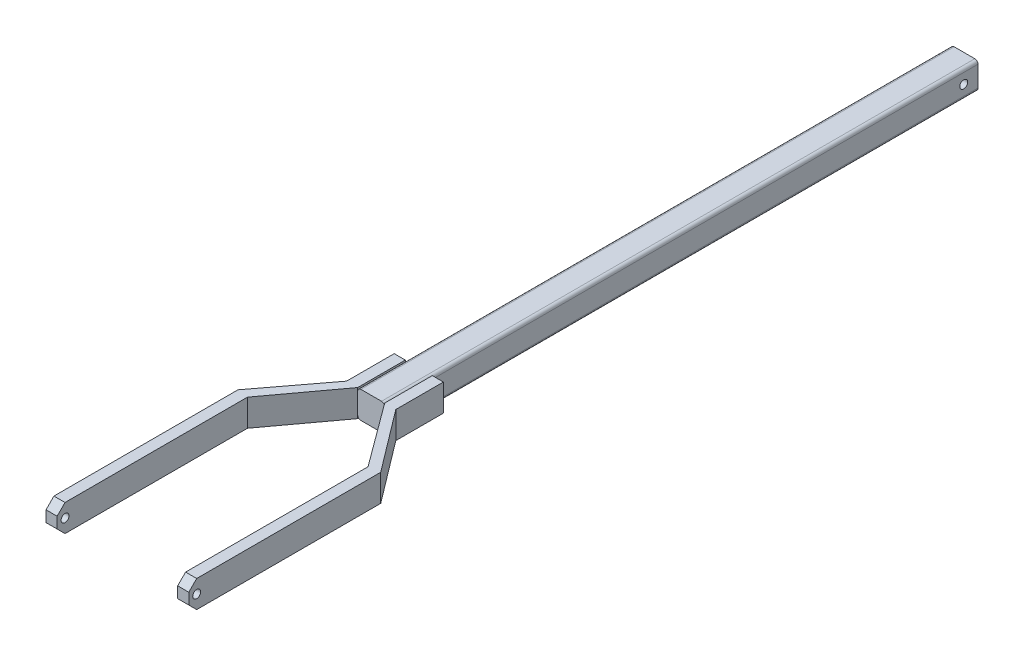
ISO-10303-21;
HEADER;
FILE_DESCRIPTION(('STEP AP214'),'2;1');
FILE_NAME('part.step','',(''),(''),'','','');
FILE_SCHEMA(('AUTOMOTIVE_DESIGN { 1 0 10303 214 1 1 1 1 }'));
ENDSEC;
DATA;
#1=APPLICATION_CONTEXT('core data for automotive mechanical design processes');
#2=APPLICATION_PROTOCOL_DEFINITION('international standard','automotive_design',2000,#1);
#3=PRODUCT_CONTEXT('',#1,'mechanical');
#4=PRODUCT('Part','Part','',(#3));
#5=PRODUCT_RELATED_PRODUCT_CATEGORY('part','',(#4));
#6=PRODUCT_DEFINITION_FORMATION('','',#4);
#7=PRODUCT_DEFINITION_CONTEXT('part definition',#1,'design');
#8=PRODUCT_DEFINITION('design','',#6,#7);
#9=PRODUCT_DEFINITION_SHAPE('','',#8);
#10=(LENGTH_UNIT() NAMED_UNIT(*) SI_UNIT(.MILLI.,.METRE.));
#11=(NAMED_UNIT(*) PLANE_ANGLE_UNIT() SI_UNIT($,.RADIAN.));
#12=(NAMED_UNIT(*) SI_UNIT($,.STERADIAN.) SOLID_ANGLE_UNIT());
#13=UNCERTAINTY_MEASURE_WITH_UNIT(LENGTH_MEASURE(1.E-05),#10,'distance_accuracy_value','');
#14=(GEOMETRIC_REPRESENTATION_CONTEXT(3) GLOBAL_UNCERTAINTY_ASSIGNED_CONTEXT((#13)) GLOBAL_UNIT_ASSIGNED_CONTEXT((#10,
#11,#12)) REPRESENTATION_CONTEXT('',''));
#15=CARTESIAN_POINT('',(0.,0.,0.));
#16=DIRECTION('',(0.,0.,1.));
#17=DIRECTION('',(1.,0.,0.));
#18=AXIS2_PLACEMENT_3D('',#15,#16,#17);
#19=CARTESIAN_POINT('',(-25.1421016274333,24.9094176838767,374.));
#20=DIRECTION('',(0.,0.,-1.));
#21=DIRECTION('',(-1.,0.,0.));
#22=AXIS2_PLACEMENT_3D('',#19,#20,#21);
#23=CYLINDRICAL_SURFACE('',#22,2.);
#24=CARTESIAN_POINT('',(-25.1421016274333,24.9094176838767,0.));
#25=DIRECTION('',(0.,0.,1.));
#26=DIRECTION('',(-1.,0.,0.));
#27=AXIS2_PLACEMENT_3D('',#24,#25,#26);
#28=CIRCLE('',#27,2.);
#29=CARTESIAN_POINT('',(-23.1421016274333,24.9094176838767,0.));
#30=VERTEX_POINT('',#29);
#31=CARTESIAN_POINT('',(-25.1421016274333,26.9094176838767,0.));
#32=VERTEX_POINT('',#31);
#33=EDGE_CURVE('E321',#30,#32,#28,.T.);
#34=ORIENTED_EDGE('',*,*,#33,.T.);
#35=DIRECTION('',(0.,0.,-1.));
#36=VECTOR('',#35,1.);
#37=CARTESIAN_POINT('',(-25.1421016274333,26.9094176838767,374.));
#38=LINE('',#37,#36);
#39=CARTESIAN_POINT('',(-25.1421016274333,26.9094176838767,374.));
#40=VERTEX_POINT('',#39);
#41=EDGE_CURVE('E11',#40,#32,#38,.T.);
#42=ORIENTED_EDGE('',*,*,#41,.F.);
#43=CARTESIAN_POINT('',(-25.1421016274333,24.9094176838767,374.));
#44=DIRECTION('',(0.,0.,1.));
#45=DIRECTION('',(-1.,0.,0.));
#46=AXIS2_PLACEMENT_3D('',#43,#44,#45);
#47=CIRCLE('',#46,2.);
#48=CARTESIAN_POINT('',(-23.1421016274333,24.9094176838767,374.));
#49=VERTEX_POINT('',#48);
#50=EDGE_CURVE('E342',#49,#40,#47,.T.);
#51=ORIENTED_EDGE('',*,*,#50,.F.);
#52=DIRECTION('',(0.,0.,-1.));
#53=VECTOR('',#52,1.);
#54=CARTESIAN_POINT('',(-23.1421016274333,24.9094176838767,374.));
#55=LINE('',#54,#53);
#56=CARTESIAN_POINT('',(-23.1421016274333,24.9094176838767,344.));
#57=VERTEX_POINT('',#56);
#58=EDGE_CURVE('E384',#49,#57,#55,.T.);
#59=ORIENTED_EDGE('',*,*,#58,.T.);
#60=EDGE_CURVE('E364',#57,#30,#55,.T.);
#61=ORIENTED_EDGE('',*,*,#60,.T.);
#62=EDGE_LOOP('',(#34,#42,#51,#59,#61));
#63=FACE_BOUND('',#62,.T.);
#64=ADVANCED_FACE('F33',(#63),#23,.T.);
#65=CARTESIAN_POINT('',(-38.1421016274332,26.9094176838767,374.));
#66=DIRECTION('',(0.,-1.,0.));
#67=DIRECTION('',(0.,0.,-1.));
#68=AXIS2_PLACEMENT_3D('',#65,#66,#67);
#69=PLANE('',#68);
#70=DIRECTION('',(-1.,0.,0.));
#71=VECTOR('',#70,1.);
#72=CARTESIAN_POINT('',(-38.1421016274332,26.9094176838767,0.));
#73=LINE('',#72,#71);
#74=CARTESIAN_POINT('',(-38.1421016274332,26.9094176838767,0.));
#75=VERTEX_POINT('',#74);
#76=EDGE_CURVE('E367',#32,#75,#73,.T.);
#77=ORIENTED_EDGE('',*,*,#76,.T.);
#78=DIRECTION('',(0.,0.,-1.));
#79=VECTOR('',#78,1.);
#80=CARTESIAN_POINT('',(-38.1421016274332,26.9094176838767,374.));
#81=LINE('',#80,#79);
#82=CARTESIAN_POINT('',(-38.1421016274332,26.9094176838767,374.));
#83=VERTEX_POINT('',#82);
#84=EDGE_CURVE('E41',#83,#75,#81,.T.);
#85=ORIENTED_EDGE('',*,*,#84,.F.);
#86=DIRECTION('',(-1.,0.,0.));
#87=VECTOR('',#86,1.);
#88=CARTESIAN_POINT('',(-38.1421016274332,26.9094176838767,374.));
#89=LINE('',#88,#87);
#90=EDGE_CURVE('E345',#40,#83,#89,.T.);
#91=ORIENTED_EDGE('',*,*,#90,.F.);
#92=ORIENTED_EDGE('',*,*,#41,.T.);
#93=EDGE_LOOP('',(#77,#85,#91,#92));
#94=FACE_BOUND('',#93,.T.);
#95=ADVANCED_FACE('F558',(#94),#69,.F.);
#96=CARTESIAN_POINT('',(-38.1421016274333,24.9094176838767,374.));
#97=DIRECTION('',(0.,0.,-1.));
#98=DIRECTION('',(-1.,0.,0.));
#99=AXIS2_PLACEMENT_3D('',#96,#97,#98);
#100=CYLINDRICAL_SURFACE('',#99,2.);
#101=CARTESIAN_POINT('',(-38.1421016274333,24.9094176838767,0.));
#102=DIRECTION('',(0.,0.,1.));
#103=DIRECTION('',(-1.,0.,0.));
#104=AXIS2_PLACEMENT_3D('',#101,#102,#103);
#105=CIRCLE('',#104,2.);
#106=CARTESIAN_POINT('',(-40.1421016274333,24.9094176838767,0.));
#107=VERTEX_POINT('',#106);
#108=EDGE_CURVE('E369',#75,#107,#105,.T.);
#109=ORIENTED_EDGE('',*,*,#108,.T.);
#110=DIRECTION('',(0.,0.,-1.));
#111=VECTOR('',#110,1.);
#112=CARTESIAN_POINT('',(-40.1421016274333,24.9094176838767,374.));
#113=LINE('',#112,#111);
#114=CARTESIAN_POINT('',(-40.1421016274333,24.9094176838767,344.));
#115=VERTEX_POINT('',#114);
#116=EDGE_CURVE('E400',#115,#107,#113,.T.);
#117=ORIENTED_EDGE('',*,*,#116,.F.);
#118=CARTESIAN_POINT('',(-40.1421016274333,24.9094176838767,374.));
#119=VERTEX_POINT('',#118);
#120=EDGE_CURVE('E401',#119,#115,#113,.T.);
#121=ORIENTED_EDGE('',*,*,#120,.F.);
#122=CARTESIAN_POINT('',(-38.1421016274333,24.9094176838767,374.));
#123=DIRECTION('',(0.,0.,1.));
#124=DIRECTION('',(-1.,0.,0.));
#125=AXIS2_PLACEMENT_3D('',#122,#123,#124);
#126=CIRCLE('',#125,2.);
#127=EDGE_CURVE('E348',#83,#119,#126,.T.);
#128=ORIENTED_EDGE('',*,*,#127,.F.);
#129=ORIENTED_EDGE('',*,*,#84,.T.);
#130=EDGE_LOOP('',(#109,#117,#121,#128,#129));
#131=FACE_BOUND('',#130,.T.);
#132=ADVANCED_FACE('F408',(#131),#100,.T.);
#133=CARTESIAN_POINT('',(-40.1421016274333,24.9094176838767,374.));
#134=DIRECTION('',(1.,0.,0.));
#135=DIRECTION('',(0.,1.,0.));
#136=AXIS2_PLACEMENT_3D('',#133,#134,#135);
#137=PLANE('',#136);
#138=CARTESIAN_POINT('',(-40.1421016274333,18.4094176838767,9.));
#139=DIRECTION('',(1.,0.,0.));
#140=DIRECTION('',(0.,1.,0.));
#141=AXIS2_PLACEMENT_3D('',#138,#139,#140);
#142=CIRCLE('',#141,2.5);
#143=CARTESIAN_POINT('',(-40.1421016274333,20.9094176838767,9.));
#144=VERTEX_POINT('',#143);
#145=EDGE_CURVE('E495',#144,#144,#142,.T.);
#146=ORIENTED_EDGE('',*,*,#145,.T.);
#147=EDGE_LOOP('',(#146));
#148=FACE_BOUND('',#147,.T.);
#149=DIRECTION('',(0.,0.,-1.));
#150=VECTOR('',#149,1.);
#151=CARTESIAN_POINT('',(-40.1421016274332,11.9094176838767,374.));
#152=LINE('',#151,#150);
#153=CARTESIAN_POINT('',(-40.1421016274333,11.9094176838767,344.));
#154=VERTEX_POINT('',#153);
#155=CARTESIAN_POINT('',(-40.1421016274332,11.9094176838767,0.));
#156=VERTEX_POINT('',#155);
#157=EDGE_CURVE('E396',#154,#156,#152,.T.);
#158=ORIENTED_EDGE('',*,*,#157,.F.);
#159=DIRECTION('',(0.,1.,0.));
#160=VECTOR('',#159,1.);
#161=CARTESIAN_POINT('',(-40.1421016274333,9.90941768387672,344.));
#162=LINE('',#161,#160);
#163=EDGE_CURVE('E272',#154,#115,#162,.T.);
#164=ORIENTED_EDGE('',*,*,#163,.T.);
#165=ORIENTED_EDGE('',*,*,#116,.T.);
#166=DIRECTION('',(0.,-1.,0.));
#167=VECTOR('',#166,1.);
#168=CARTESIAN_POINT('',(-40.1421016274333,24.9094176838767,0.));
#169=LINE('',#168,#167);
#170=EDGE_CURVE('E372',#107,#156,#169,.T.);
#171=ORIENTED_EDGE('',*,*,#170,.T.);
#172=EDGE_LOOP('',(#158,#164,#165,#171));
#173=FACE_BOUND('',#172,.T.);
#174=ADVANCED_FACE('F420',(#148,#173),#137,.F.);
#175=CARTESIAN_POINT('',(-38.1421016274332,11.9094176838767,374.));
#176=DIRECTION('',(0.,0.,-1.));
#177=DIRECTION('',(-1.,0.,0.));
#178=AXIS2_PLACEMENT_3D('',#175,#176,#177);
#179=CYLINDRICAL_SURFACE('',#178,2.);
#180=CARTESIAN_POINT('',(-38.1421016274332,11.9094176838767,0.));
#181=DIRECTION('',(0.,0.,1.));
#182=DIRECTION('',(-1.,0.,0.));
#183=AXIS2_PLACEMENT_3D('',#180,#181,#182);
#184=CIRCLE('',#183,2.);
#185=CARTESIAN_POINT('',(-38.1421016274332,9.90941768387672,0.));
#186=VERTEX_POINT('',#185);
#187=EDGE_CURVE('E375',#156,#186,#184,.T.);
#188=ORIENTED_EDGE('',*,*,#187,.T.);
#189=DIRECTION('',(0.,0.,-1.));
#190=VECTOR('',#189,1.);
#191=CARTESIAN_POINT('',(-38.1421016274332,9.90941768387672,374.));
#192=LINE('',#191,#190);
#193=CARTESIAN_POINT('',(-38.1421016274332,9.90941768387672,374.));
#194=VERTEX_POINT('',#193);
#195=EDGE_CURVE('E393',#194,#186,#192,.T.);
#196=ORIENTED_EDGE('',*,*,#195,.F.);
#197=CARTESIAN_POINT('',(-38.1421016274332,11.9094176838767,374.));
#198=DIRECTION('',(0.,0.,1.));
#199=DIRECTION('',(-1.,0.,0.));
#200=AXIS2_PLACEMENT_3D('',#197,#198,#199);
#201=CIRCLE('',#200,2.);
#202=CARTESIAN_POINT('',(-40.1421016274332,11.9094176838767,374.));
#203=VERTEX_POINT('',#202);
#204=EDGE_CURVE('E354',#203,#194,#201,.T.);
#205=ORIENTED_EDGE('',*,*,#204,.F.);
#206=EDGE_CURVE('E397',#203,#154,#152,.T.);
#207=ORIENTED_EDGE('',*,*,#206,.T.);
#208=ORIENTED_EDGE('',*,*,#157,.T.);
#209=EDGE_LOOP('',(#188,#196,#205,#207,#208));
#210=FACE_BOUND('',#209,.T.);
#211=ADVANCED_FACE('F584',(#210),#179,.T.);
#212=CARTESIAN_POINT('',(-38.1421016274332,9.90941768387672,374.));
#213=DIRECTION('',(0.,1.,0.));
#214=DIRECTION('',(0.,0.,1.));
#215=AXIS2_PLACEMENT_3D('',#212,#213,#214);
#216=PLANE('',#215);
#217=DIRECTION('',(1.,0.,0.));
#218=VECTOR('',#217,1.);
#219=CARTESIAN_POINT('',(-38.1421016274332,9.90941768387672,0.));
#220=LINE('',#219,#218);
#221=CARTESIAN_POINT('',(-25.1421016274333,9.90941768387672,0.));
#222=VERTEX_POINT('',#221);
#223=EDGE_CURVE('E377',#186,#222,#220,.T.);
#224=ORIENTED_EDGE('',*,*,#223,.T.);
#225=DIRECTION('',(0.,0.,-1.));
#226=VECTOR('',#225,1.);
#227=CARTESIAN_POINT('',(-25.1421016274333,9.90941768387672,374.));
#228=LINE('',#227,#226);
#229=CARTESIAN_POINT('',(-25.1421016274333,9.90941768387672,374.));
#230=VERTEX_POINT('',#229);
#231=EDGE_CURVE('E390',#230,#222,#228,.T.);
#232=ORIENTED_EDGE('',*,*,#231,.F.);
#233=DIRECTION('',(1.,0.,0.));
#234=VECTOR('',#233,1.);
#235=CARTESIAN_POINT('',(-38.1421016274332,9.90941768387672,374.));
#236=LINE('',#235,#234);
#237=EDGE_CURVE('E356',#194,#230,#236,.T.);
#238=ORIENTED_EDGE('',*,*,#237,.F.);
#239=ORIENTED_EDGE('',*,*,#195,.T.);
#240=EDGE_LOOP('',(#224,#232,#238,#239));
#241=FACE_BOUND('',#240,.T.);
#242=ADVANCED_FACE('F580',(#241),#216,.F.);
#243=CARTESIAN_POINT('',(-25.1421016274333,11.9094176838767,374.));
#244=DIRECTION('',(0.,0.,-1.));
#245=DIRECTION('',(-1.,0.,0.));
#246=AXIS2_PLACEMENT_3D('',#243,#244,#245);
#247=CYLINDRICAL_SURFACE('',#246,2.);
#248=CARTESIAN_POINT('',(-25.1421016274333,11.9094176838767,0.));
#249=DIRECTION('',(0.,0.,1.));
#250=DIRECTION('',(-1.,0.,0.));
#251=AXIS2_PLACEMENT_3D('',#248,#249,#250);
#252=CIRCLE('',#251,2.);
#253=CARTESIAN_POINT('',(-23.1421016274333,11.9094176838767,0.));
#254=VERTEX_POINT('',#253);
#255=EDGE_CURVE('E379',#222,#254,#252,.T.);
#256=ORIENTED_EDGE('',*,*,#255,.T.);
#257=DIRECTION('',(0.,0.,-1.));
#258=VECTOR('',#257,1.);
#259=CARTESIAN_POINT('',(-23.1421016274333,11.9094176838767,374.));
#260=LINE('',#259,#258);
#261=CARTESIAN_POINT('',(-23.1421016274333,11.9094176838767,344.));
#262=VERTEX_POINT('',#261);
#263=EDGE_CURVE('E387',#262,#254,#260,.T.);
#264=ORIENTED_EDGE('',*,*,#263,.F.);
#265=CARTESIAN_POINT('',(-23.1421016274333,11.9094176838767,374.));
#266=VERTEX_POINT('',#265);
#267=EDGE_CURVE('E388',#266,#262,#260,.T.);
#268=ORIENTED_EDGE('',*,*,#267,.F.);
#269=CARTESIAN_POINT('',(-25.1421016274333,11.9094176838767,374.));
#270=DIRECTION('',(0.,0.,1.));
#271=DIRECTION('',(-1.,0.,0.));
#272=AXIS2_PLACEMENT_3D('',#269,#270,#271);
#273=CIRCLE('',#272,2.);
#274=EDGE_CURVE('E358',#230,#266,#273,.T.);
#275=ORIENTED_EDGE('',*,*,#274,.F.);
#276=ORIENTED_EDGE('',*,*,#231,.T.);
#277=EDGE_LOOP('',(#256,#264,#268,#275,#276));
#278=FACE_BOUND('',#277,.T.);
#279=ADVANCED_FACE('F575',(#278),#247,.T.);
#280=CARTESIAN_POINT('',(-23.1421016274333,24.9094176838767,374.));
#281=DIRECTION('',(-1.,0.,0.));
#282=DIRECTION('',(0.,-1.,0.));
#283=AXIS2_PLACEMENT_3D('',#280,#281,#282);
#284=PLANE('',#283);
#285=CARTESIAN_POINT('',(-23.1421016274333,18.4094176838767,9.));
#286=DIRECTION('',(-1.,0.,0.));
#287=DIRECTION('',(0.,-1.,0.));
#288=AXIS2_PLACEMENT_3D('',#285,#286,#287);
#289=CIRCLE('',#288,2.5);
#290=CARTESIAN_POINT('',(-23.1421016274333,15.9094176838767,9.));
#291=VERTEX_POINT('',#290);
#292=EDGE_CURVE('E36',#291,#291,#289,.T.);
#293=ORIENTED_EDGE('',*,*,#292,.T.);
#294=EDGE_LOOP('',(#293));
#295=FACE_BOUND('',#294,.T.);
#296=ORIENTED_EDGE('',*,*,#60,.F.);
#297=DIRECTION('',(0.,1.,0.));
#298=VECTOR('',#297,1.);
#299=CARTESIAN_POINT('',(-23.1421016274333,9.90941768387672,344.));
#300=LINE('',#299,#298);
#301=EDGE_CURVE('E326',#262,#57,#300,.T.);
#302=ORIENTED_EDGE('',*,*,#301,.F.);
#303=ORIENTED_EDGE('',*,*,#263,.T.);
#304=DIRECTION('',(0.,1.,0.));
#305=VECTOR('',#304,1.);
#306=CARTESIAN_POINT('',(-23.1421016274333,24.9094176838767,0.));
#307=LINE('',#306,#305);
#308=EDGE_CURVE('E346',#254,#30,#307,.T.);
#309=ORIENTED_EDGE('',*,*,#308,.T.);
#310=EDGE_LOOP('',(#296,#302,#303,#309));
#311=FACE_BOUND('',#310,.T.);
#312=ADVANCED_FACE('F569',(#295,#311),#284,.F.);
#313=CARTESIAN_POINT('',(-25.1421016274333,24.9094176838767,374.));
#314=DIRECTION('',(0.,0.,-1.));
#315=DIRECTION('',(-1.,0.,0.));
#316=AXIS2_PLACEMENT_3D('',#313,#314,#315);
#317=PLANE('',#316);
#318=ORIENTED_EDGE('',*,*,#50,.T.);
#319=ORIENTED_EDGE('',*,*,#90,.T.);
#320=ORIENTED_EDGE('',*,*,#127,.T.);
#321=DIRECTION('',(0.,-1.,0.));
#322=VECTOR('',#321,1.);
#323=CARTESIAN_POINT('',(-40.1421016274333,24.9094176838767,374.));
#324=LINE('',#323,#322);
#325=EDGE_CURVE('E351',#119,#203,#324,.T.);
#326=ORIENTED_EDGE('',*,*,#325,.T.);
#327=ORIENTED_EDGE('',*,*,#204,.T.);
#328=ORIENTED_EDGE('',*,*,#237,.T.);
#329=ORIENTED_EDGE('',*,*,#274,.T.);
#330=DIRECTION('',(0.,1.,0.));
#331=VECTOR('',#330,1.);
#332=CARTESIAN_POINT('',(-23.1421016274333,24.9094176838767,374.));
#333=LINE('',#332,#331);
#334=EDGE_CURVE('E361',#266,#49,#333,.T.);
#335=ORIENTED_EDGE('',*,*,#334,.T.);
#336=EDGE_LOOP('',(#318,#319,#320,#326,#327,#328,#329,#335));
#337=FACE_BOUND('',#336,.T.);
#338=ADVANCED_FACE('F590',(#337),#317,.F.);
#339=CARTESIAN_POINT('',(-25.1421016274333,24.9094176838767,0.));
#340=DIRECTION('',(0.,0.,-1.));
#341=DIRECTION('',(-1.,0.,0.));
#342=AXIS2_PLACEMENT_3D('',#339,#340,#341);
#343=PLANE('',#342);
#344=ORIENTED_EDGE('',*,*,#33,.F.);
#345=ORIENTED_EDGE('',*,*,#308,.F.);
#346=ORIENTED_EDGE('',*,*,#255,.F.);
#347=ORIENTED_EDGE('',*,*,#223,.F.);
#348=ORIENTED_EDGE('',*,*,#187,.F.);
#349=ORIENTED_EDGE('',*,*,#170,.F.);
#350=ORIENTED_EDGE('',*,*,#108,.F.);
#351=ORIENTED_EDGE('',*,*,#76,.F.);
#352=EDGE_LOOP('',(#344,#345,#346,#347,#348,#349,#350,#351));
#353=FACE_BOUND('',#352,.T.);
#354=ADVANCED_FACE('F415',(#353),#343,.T.);
#355=CARTESIAN_POINT('',(-23.1421016274333,9.90941768387672,374.));
#356=DIRECTION('',(-1.,0.,0.));
#357=DIRECTION('',(0.,0.,1.));
#358=AXIS2_PLACEMENT_3D('',#355,#356,#357);
#359=PLANE('',#358);
#360=ORIENTED_EDGE('',*,*,#58,.F.);
#361=DIRECTION('',(0.,1.,0.));
#362=VECTOR('',#361,1.);
#363=CARTESIAN_POINT('',(-23.1421016274333,9.90941768387672,374.));
#364=LINE('',#363,#362);
#365=CARTESIAN_POINT('',(-23.1421016274333,26.9094176838767,374.));
#366=VERTEX_POINT('',#365);
#367=EDGE_CURVE('E322',#49,#366,#364,.T.);
#368=ORIENTED_EDGE('',*,*,#367,.T.);
#369=DIRECTION('',(0.,0.,1.));
#370=VECTOR('',#369,1.);
#371=CARTESIAN_POINT('',(-23.1421016274333,26.9094176838767,374.));
#372=LINE('',#371,#370);
#373=CARTESIAN_POINT('',(-23.1421016274333,26.9094176838767,344.));
#374=VERTEX_POINT('',#373);
#375=EDGE_CURVE('E281',#374,#366,#372,.T.);
#376=ORIENTED_EDGE('',*,*,#375,.F.);
#377=EDGE_CURVE('E327',#57,#374,#300,.T.);
#378=ORIENTED_EDGE('',*,*,#377,.F.);
#379=EDGE_LOOP('',(#360,#368,#376,#378));
#380=FACE_BOUND('',#379,.T.);
#381=ADVANCED_FACE('F593',(#380),#359,.T.);
#382=CARTESIAN_POINT('',(6.35789837256673,9.90941768387672,414.));
#383=DIRECTION('',(-0.804802908723929,0.,0.593542145183897));
#384=DIRECTION('',(0.593542145183897,0.,0.804802908723929));
#385=AXIS2_PLACEMENT_3D('',#382,#383,#384);
#386=PLANE('',#385);
#387=DIRECTION('',(0.593542145183897,0.,0.804802908723929));
#388=VECTOR('',#387,1.);
#389=CARTESIAN_POINT('',(6.35789837256673,26.9094176838767,414.));
#390=LINE('',#389,#388);
#391=CARTESIAN_POINT('',(6.35789837256673,26.9094176838767,414.));
#392=VERTEX_POINT('',#391);
#393=EDGE_CURVE('E299',#366,#392,#390,.T.);
#394=ORIENTED_EDGE('',*,*,#393,.F.);
#395=ORIENTED_EDGE('',*,*,#367,.F.);
#396=ORIENTED_EDGE('',*,*,#334,.F.);
#397=CARTESIAN_POINT('',(-23.1421016274333,9.90941768387672,374.));
#398=VERTEX_POINT('',#397);
#399=EDGE_CURVE('E318',#398,#266,#364,.T.);
#400=ORIENTED_EDGE('',*,*,#399,.F.);
#401=DIRECTION('',(0.593542145183897,0.,0.804802908723929));
#402=VECTOR('',#401,1.);
#403=CARTESIAN_POINT('',(6.35789837256673,9.90941768387672,414.));
#404=LINE('',#403,#402);
#405=CARTESIAN_POINT('',(6.35789837256673,9.90941768387672,414.));
#406=VERTEX_POINT('',#405);
#407=EDGE_CURVE('E277',#398,#406,#404,.T.);
#408=ORIENTED_EDGE('',*,*,#407,.T.);
#409=DIRECTION('',(0.,1.,0.));
#410=VECTOR('',#409,1.);
#411=CARTESIAN_POINT('',(6.35789837256673,9.90941768387672,414.));
#412=LINE('',#411,#410);
#413=EDGE_CURVE('E298',#406,#392,#412,.T.);
#414=ORIENTED_EDGE('',*,*,#413,.T.);
#415=EDGE_LOOP('',(#394,#395,#396,#400,#408,#414));
#416=FACE_BOUND('',#415,.T.);
#417=ADVANCED_FACE('F604',(#416),#386,.T.);
#418=ORIENTED_EDGE('',*,*,#399,.T.);
#419=ORIENTED_EDGE('',*,*,#267,.T.);
#420=CARTESIAN_POINT('',(-23.1421016274333,9.90941768387672,344.));
#421=VERTEX_POINT('',#420);
#422=EDGE_CURVE('E323',#421,#262,#300,.T.);
#423=ORIENTED_EDGE('',*,*,#422,.F.);
#424=DIRECTION('',(0.,0.,1.));
#425=VECTOR('',#424,1.);
#426=CARTESIAN_POINT('',(-23.1421016274333,9.90941768387672,374.));
#427=LINE('',#426,#425);
#428=EDGE_CURVE('E295',#421,#398,#427,.T.);
#429=ORIENTED_EDGE('',*,*,#428,.T.);
#430=EDGE_LOOP('',(#418,#419,#423,#429));
#431=FACE_BOUND('',#430,.T.);
#432=ADVANCED_FACE('F601',(#431),#359,.T.);
#433=CARTESIAN_POINT('',(-23.1421016274333,9.90941768387672,344.));
#434=DIRECTION('',(0.,0.,-1.));
#435=DIRECTION('',(-1.,0.,0.));
#436=AXIS2_PLACEMENT_3D('',#433,#434,#435);
#437=PLANE('',#436);
#438=DIRECTION('',(-1.,0.,0.));
#439=VECTOR('',#438,1.);
#440=CARTESIAN_POINT('',(-23.1421016274333,26.9094176838767,344.));
#441=LINE('',#440,#439);
#442=CARTESIAN_POINT('',(-16.1421016274333,26.9094176838767,344.));
#443=VERTEX_POINT('',#442);
#444=EDGE_CURVE('E313',#443,#374,#441,.T.);
#445=ORIENTED_EDGE('',*,*,#444,.F.);
#446=DIRECTION('',(0.,1.,0.));
#447=VECTOR('',#446,1.);
#448=CARTESIAN_POINT('',(-16.1421016274333,9.90941768387672,344.));
#449=LINE('',#448,#447);
#450=CARTESIAN_POINT('',(-16.1421016274333,9.90941768387672,344.));
#451=VERTEX_POINT('',#450);
#452=EDGE_CURVE('E328',#451,#443,#449,.T.);
#453=ORIENTED_EDGE('',*,*,#452,.F.);
#454=DIRECTION('',(-1.,0.,0.));
#455=VECTOR('',#454,1.);
#456=CARTESIAN_POINT('',(-23.1421016274333,9.90941768387672,344.));
#457=LINE('',#456,#455);
#458=EDGE_CURVE('E292',#451,#421,#457,.T.);
#459=ORIENTED_EDGE('',*,*,#458,.T.);
#460=ORIENTED_EDGE('',*,*,#422,.T.);
#461=ORIENTED_EDGE('',*,*,#301,.T.);
#462=ORIENTED_EDGE('',*,*,#377,.T.);
#463=EDGE_LOOP('',(#445,#453,#459,#460,#461,#462));
#464=FACE_BOUND('',#463,.T.);
#465=ADVANCED_FACE('F598',(#464),#437,.T.);
#466=CARTESIAN_POINT('',(-16.1421016274333,9.90941768387672,344.));
#467=DIRECTION('',(1.,0.,0.));
#468=DIRECTION('',(0.,0.,-1.));
#469=AXIS2_PLACEMENT_3D('',#466,#467,#468);
#470=PLANE('',#469);
#471=DIRECTION('',(0.,0.,-1.));
#472=VECTOR('',#471,1.);
#473=CARTESIAN_POINT('',(-16.1421016274333,26.9094176838767,344.));
#474=LINE('',#473,#472);
#475=CARTESIAN_POINT('',(-16.1421016274333,26.9094176838767,374.));
#476=VERTEX_POINT('',#475);
#477=EDGE_CURVE('E310',#476,#443,#474,.T.);
#478=ORIENTED_EDGE('',*,*,#477,.F.);
#479=DIRECTION('',(0.,1.,0.));
#480=VECTOR('',#479,1.);
#481=CARTESIAN_POINT('',(-16.1421016274333,9.90941768387672,374.));
#482=LINE('',#481,#480);
#483=CARTESIAN_POINT('',(-16.1421016274333,9.90941768387672,374.));
#484=VERTEX_POINT('',#483);
#485=EDGE_CURVE('E330',#484,#476,#482,.T.);
#486=ORIENTED_EDGE('',*,*,#485,.F.);
#487=DIRECTION('',(0.,0.,-1.));
#488=VECTOR('',#487,1.);
#489=CARTESIAN_POINT('',(-16.1421016274333,9.90941768387672,344.));
#490=LINE('',#489,#488);
#491=EDGE_CURVE('E289',#484,#451,#490,.T.);
#492=ORIENTED_EDGE('',*,*,#491,.T.);
#493=ORIENTED_EDGE('',*,*,#452,.T.);
#494=EDGE_LOOP('',(#478,#486,#492,#493));
#495=FACE_BOUND('',#494,.T.);
#496=ADVANCED_FACE('F606',(#495),#470,.T.);
#497=CARTESIAN_POINT('',(-16.1421016274333,9.90941768387672,374.));
#498=DIRECTION('',(0.79753934170561,0.,-0.603266937956807));
#499=DIRECTION('',(-0.603266937956807,0.,-0.79753934170561));
#500=AXIS2_PLACEMENT_3D('',#497,#498,#499);
#501=PLANE('',#500);
#502=DIRECTION('',(-0.603266937956807,0.,-0.79753934170561));
#503=VECTOR('',#502,1.);
#504=CARTESIAN_POINT('',(-16.1421016274333,26.9094176838767,374.));
#505=LINE('',#504,#503);
#506=CARTESIAN_POINT('',(13.3578983725667,26.9094176838767,413.));
#507=VERTEX_POINT('',#506);
#508=EDGE_CURVE('E307',#507,#476,#505,.T.);
#509=ORIENTED_EDGE('',*,*,#508,.F.);
#510=DIRECTION('',(0.,1.,0.));
#511=VECTOR('',#510,1.);
#512=CARTESIAN_POINT('',(13.3578983725667,9.90941768387672,413.));
#513=LINE('',#512,#511);
#514=CARTESIAN_POINT('',(13.3578983725667,9.90941768387672,413.));
#515=VERTEX_POINT('',#514);
#516=EDGE_CURVE('E332',#515,#507,#513,.T.);
#517=ORIENTED_EDGE('',*,*,#516,.F.);
#518=DIRECTION('',(-0.603266937956807,0.,-0.79753934170561));
#519=VECTOR('',#518,1.);
#520=CARTESIAN_POINT('',(-16.1421016274333,9.90941768387672,374.));
#521=LINE('',#520,#519);
#522=EDGE_CURVE('E286',#515,#484,#521,.T.);
#523=ORIENTED_EDGE('',*,*,#522,.T.);
#524=ORIENTED_EDGE('',*,*,#485,.T.);
#525=EDGE_LOOP('',(#509,#517,#523,#524));
#526=FACE_BOUND('',#525,.T.);
#527=ADVANCED_FACE('F534',(#526),#501,.T.);
#528=CARTESIAN_POINT('',(13.3578983725667,9.90941768387672,413.));
#529=DIRECTION('',(1.,0.,0.));
#530=DIRECTION('',(0.,0.,-1.));
#531=AXIS2_PLACEMENT_3D('',#528,#529,#530);
#532=PLANE('',#531);
#533=DIRECTION('',(0.,0.707106781186552,-0.707106781186543));
#534=VECTOR('',#533,1.);
#535=CARTESIAN_POINT('',(13.3578983725667,26.9094176838767,529.));
#536=LINE('',#535,#534);
#537=CARTESIAN_POINT('',(13.3578983725667,21.9094176838767,534.));
#538=VERTEX_POINT('',#537);
#539=CARTESIAN_POINT('',(13.3578983725667,26.9094176838767,529.));
#540=VERTEX_POINT('',#539);
#541=EDGE_CURVE('E56',#538,#540,#536,.T.);
#542=ORIENTED_EDGE('',*,*,#541,.F.);
#543=DIRECTION('',(0.,1.,0.));
#544=VECTOR('',#543,1.);
#545=CARTESIAN_POINT('',(13.3578983725667,9.90941768387672,534.));
#546=LINE('',#545,#544);
#547=CARTESIAN_POINT('',(13.3578983725667,14.9094176838767,534.));
#548=VERTEX_POINT('',#547);
#549=EDGE_CURVE('E335',#548,#538,#546,.T.);
#550=ORIENTED_EDGE('',*,*,#549,.F.);
#551=DIRECTION('',(0.,0.707106781186547,0.707106781186548));
#552=VECTOR('',#551,1.);
#553=CARTESIAN_POINT('',(13.3578983725667,14.9094176838767,534.));
#554=LINE('',#553,#552);
#555=CARTESIAN_POINT('',(13.3578983725667,9.90941768387672,529.));
#556=VERTEX_POINT('',#555);
#557=EDGE_CURVE('E514',#556,#548,#554,.T.);
#558=ORIENTED_EDGE('',*,*,#557,.F.);
#559=DIRECTION('',(0.,0.,-1.));
#560=VECTOR('',#559,1.);
#561=CARTESIAN_POINT('',(13.3578983725667,9.90941768387672,413.));
#562=LINE('',#561,#560);
#563=EDGE_CURVE('E284',#556,#515,#562,.T.);
#564=ORIENTED_EDGE('',*,*,#563,.T.);
#565=ORIENTED_EDGE('',*,*,#516,.T.);
#566=DIRECTION('',(0.,0.,-1.));
#567=VECTOR('',#566,1.);
#568=CARTESIAN_POINT('',(13.3578983725667,26.9094176838767,413.));
#569=LINE('',#568,#567);
#570=EDGE_CURVE('E305',#540,#507,#569,.T.);
#571=ORIENTED_EDGE('',*,*,#570,.F.);
#572=EDGE_LOOP('',(#542,#550,#558,#564,#565,#571));
#573=FACE_BOUND('',#572,.T.);
#574=CARTESIAN_POINT('',(13.3578983725667,18.4094176838767,529.));
#575=DIRECTION('',(1.,0.,0.));
#576=DIRECTION('',(0.,0.,-1.));
#577=AXIS2_PLACEMENT_3D('',#574,#575,#576);
#578=CIRCLE('',#577,2.49999999999991);
#579=CARTESIAN_POINT('',(13.3578983725667,18.4094176838767,526.5));
#580=VERTEX_POINT('',#579);
#581=EDGE_CURVE('E492',#580,#580,#578,.T.);
#582=ORIENTED_EDGE('',*,*,#581,.F.);
#583=EDGE_LOOP('',(#582));
#584=FACE_BOUND('',#583,.T.);
#585=ADVANCED_FACE('F525',(#573,#584),#532,.T.);
#586=CARTESIAN_POINT('',(13.3578983725667,9.90941768387672,534.));
#587=DIRECTION('',(0.,0.,1.));
#588=DIRECTION('',(1.,0.,0.));
#589=AXIS2_PLACEMENT_3D('',#586,#587,#588);
#590=PLANE('',#589);
#591=DIRECTION('',(1.,0.,0.));
#592=VECTOR('',#591,1.);
#593=CARTESIAN_POINT('',(-76.6421016274332,21.9094176838767,534.));
#594=LINE('',#593,#592);
#595=CARTESIAN_POINT('',(6.3578983725667,21.9094176838767,534.));
#596=VERTEX_POINT('',#595);
#597=EDGE_CURVE('E240',#596,#538,#594,.T.);
#598=ORIENTED_EDGE('',*,*,#597,.F.);
#599=DIRECTION('',(0.,1.,0.));
#600=VECTOR('',#599,1.);
#601=CARTESIAN_POINT('',(6.35789837256673,9.90941768387672,534.));
#602=LINE('',#601,#600);
#603=CARTESIAN_POINT('',(6.3578983725667,14.9094176838767,534.));
#604=VERTEX_POINT('',#603);
#605=EDGE_CURVE('E338',#604,#596,#602,.T.);
#606=ORIENTED_EDGE('',*,*,#605,.F.);
#607=DIRECTION('',(1.,0.,0.));
#608=VECTOR('',#607,1.);
#609=CARTESIAN_POINT('',(-76.6421016274332,14.9094176838767,534.));
#610=LINE('',#609,#608);
#611=EDGE_CURVE('E241',#604,#548,#610,.T.);
#612=ORIENTED_EDGE('',*,*,#611,.T.);
#613=ORIENTED_EDGE('',*,*,#549,.T.);
#614=EDGE_LOOP('',(#598,#606,#612,#613));
#615=FACE_BOUND('',#614,.T.);
#616=ADVANCED_FACE('F548',(#615),#590,.T.);
#617=CARTESIAN_POINT('',(6.35789837256673,9.90941768387672,534.));
#618=DIRECTION('',(-1.,0.,0.));
#619=DIRECTION('',(0.,0.,1.));
#620=AXIS2_PLACEMENT_3D('',#617,#618,#619);
#621=PLANE('',#620);
#622=DIRECTION('',(0.,-0.707106781186552,0.707106781186543));
#623=VECTOR('',#622,1.);
#624=CARTESIAN_POINT('',(6.35789837256673,15.9094176838766,540.));
#625=LINE('',#624,#623);
#626=CARTESIAN_POINT('',(6.3578983725667,26.9094176838767,529.));
#627=VERTEX_POINT('',#626);
#628=EDGE_CURVE('E502',#627,#596,#625,.T.);
#629=ORIENTED_EDGE('',*,*,#628,.F.);
#630=DIRECTION('',(0.,0.,1.));
#631=VECTOR('',#630,1.);
#632=CARTESIAN_POINT('',(6.35789837256673,26.9094176838767,534.));
#633=LINE('',#632,#631);
#634=EDGE_CURVE('E302',#392,#627,#633,.T.);
#635=ORIENTED_EDGE('',*,*,#634,.F.);
#636=ORIENTED_EDGE('',*,*,#413,.F.);
#637=DIRECTION('',(0.,0.,1.));
#638=VECTOR('',#637,1.);
#639=CARTESIAN_POINT('',(6.35789837256673,9.90941768387672,534.));
#640=LINE('',#639,#638);
#641=CARTESIAN_POINT('',(6.35789837256673,9.90941768387672,529.));
#642=VERTEX_POINT('',#641);
#643=EDGE_CURVE('E280',#406,#642,#640,.T.);
#644=ORIENTED_EDGE('',*,*,#643,.T.);
#645=DIRECTION('',(0.,-0.707106781186547,-0.707106781186548));
#646=VECTOR('',#645,1.);
#647=CARTESIAN_POINT('',(6.35789837256673,12.4094176838767,531.5));
#648=LINE('',#647,#646);
#649=EDGE_CURVE('E48',#604,#642,#648,.T.);
#650=ORIENTED_EDGE('',*,*,#649,.F.);
#651=ORIENTED_EDGE('',*,*,#605,.T.);
#652=EDGE_LOOP('',(#629,#635,#636,#644,#650,#651));
#653=FACE_BOUND('',#652,.T.);
#654=CARTESIAN_POINT('',(6.35789837256673,18.4094176838767,529.));
#655=DIRECTION('',(-1.,0.,0.));
#656=DIRECTION('',(0.,0.,1.));
#657=AXIS2_PLACEMENT_3D('',#654,#655,#656);
#658=CIRCLE('',#657,2.49999999999991);
#659=CARTESIAN_POINT('',(6.35789837256673,18.4094176838767,531.5));
#660=VERTEX_POINT('',#659);
#661=EDGE_CURVE('E446',#660,#660,#658,.T.);
#662=ORIENTED_EDGE('',*,*,#661,.F.);
#663=EDGE_LOOP('',(#662));
#664=FACE_BOUND('',#663,.T.);
#665=ADVANCED_FACE('F544',(#653,#664),#621,.T.);
#666=CARTESIAN_POINT('',(-45.2671016274333,9.90941768387672,344.));
#667=DIRECTION('',(0.,-1.,0.));
#668=DIRECTION('',(0.,0.,-1.));
#669=AXIS2_PLACEMENT_3D('',#666,#667,#668);
#670=PLANE('',#669);
#671=DIRECTION('',(1.,0.,0.));
#672=VECTOR('',#671,1.);
#673=CARTESIAN_POINT('',(-76.6421016274332,9.90941768387672,529.));
#674=LINE('',#673,#672);
#675=EDGE_CURVE('E508',#642,#556,#674,.T.);
#676=ORIENTED_EDGE('',*,*,#675,.F.);
#677=ORIENTED_EDGE('',*,*,#643,.F.);
#678=ORIENTED_EDGE('',*,*,#407,.F.);
#679=ORIENTED_EDGE('',*,*,#428,.F.);
#680=ORIENTED_EDGE('',*,*,#458,.F.);
#681=ORIENTED_EDGE('',*,*,#491,.F.);
#682=ORIENTED_EDGE('',*,*,#522,.F.);
#683=ORIENTED_EDGE('',*,*,#563,.F.);
#684=EDGE_LOOP('',(#676,#677,#678,#679,#680,#681,#682,#683));
#685=FACE_BOUND('',#684,.T.);
#686=ADVANCED_FACE('F529',(#685),#670,.T.);
#687=CARTESIAN_POINT('',(-45.2671016274333,26.9094176838767,344.));
#688=DIRECTION('',(0.,-1.,0.));
#689=DIRECTION('',(0.,0.,-1.));
#690=AXIS2_PLACEMENT_3D('',#687,#688,#689);
#691=PLANE('',#690);
#692=ORIENTED_EDGE('',*,*,#634,.T.);
#693=DIRECTION('',(1.,0.,0.));
#694=VECTOR('',#693,1.);
#695=CARTESIAN_POINT('',(-76.6421016274332,26.9094176838767,529.));
#696=LINE('',#695,#694);
#697=EDGE_CURVE('E511',#627,#540,#696,.T.);
#698=ORIENTED_EDGE('',*,*,#697,.T.);
#699=ORIENTED_EDGE('',*,*,#570,.T.);
#700=ORIENTED_EDGE('',*,*,#508,.T.);
#701=ORIENTED_EDGE('',*,*,#477,.T.);
#702=ORIENTED_EDGE('',*,*,#444,.T.);
#703=ORIENTED_EDGE('',*,*,#375,.T.);
#704=ORIENTED_EDGE('',*,*,#393,.T.);
#705=EDGE_LOOP('',(#692,#698,#699,#700,#701,#702,#703,#704));
#706=FACE_BOUND('',#705,.T.);
#707=ADVANCED_FACE('F538',(#706),#691,.F.);
#708=CARTESIAN_POINT('',(-40.1421016274333,9.90941768387672,374.));
#709=DIRECTION('',(1.,0.,0.));
#710=DIRECTION('',(0.,0.,-1.));
#711=AXIS2_PLACEMENT_3D('',#708,#709,#710);
#712=PLANE('',#711);
#713=ORIENTED_EDGE('',*,*,#206,.F.);
#714=DIRECTION('',(0.,1.,0.));
#715=VECTOR('',#714,1.);
#716=CARTESIAN_POINT('',(-40.1421016274333,9.90941768387672,374.));
#717=LINE('',#716,#715);
#718=CARTESIAN_POINT('',(-40.1421016274333,9.90941768387672,374.));
#719=VERTEX_POINT('',#718);
#720=EDGE_CURVE('E274',#719,#203,#717,.T.);
#721=ORIENTED_EDGE('',*,*,#720,.F.);
#722=DIRECTION('',(0.,0.,-1.));
#723=VECTOR('',#722,1.);
#724=CARTESIAN_POINT('',(-40.1421016274333,9.90941768387672,374.));
#725=LINE('',#724,#723);
#726=CARTESIAN_POINT('',(-40.1421016274333,9.90941768387672,344.));
#727=VERTEX_POINT('',#726);
#728=EDGE_CURVE('E482',#719,#727,#725,.T.);
#729=ORIENTED_EDGE('',*,*,#728,.T.);
#730=EDGE_CURVE('E269',#727,#154,#162,.T.);
#731=ORIENTED_EDGE('',*,*,#730,.T.);
#732=EDGE_LOOP('',(#713,#721,#729,#731));
#733=FACE_BOUND('',#732,.T.);
#734=ADVANCED_FACE('F587',(#733),#712,.T.);
#735=CARTESIAN_POINT('',(-69.6421016274333,9.90941768387672,414.));
#736=DIRECTION('',(0.804802908723929,0.,0.593542145183898));
#737=DIRECTION('',(0.593542145183898,0.,-0.804802908723928));
#738=AXIS2_PLACEMENT_3D('',#735,#736,#737);
#739=PLANE('',#738);
#740=DIRECTION('',(0.593542145183898,0.,-0.804802908723928));
#741=VECTOR('',#740,1.);
#742=CARTESIAN_POINT('',(-69.6421016274333,26.9094176838767,414.));
#743=LINE('',#742,#741);
#744=CARTESIAN_POINT('',(-69.6421016274333,26.9094176838767,414.));
#745=VERTEX_POINT('',#744);
#746=CARTESIAN_POINT('',(-40.1421016274333,26.9094176838767,374.));
#747=VERTEX_POINT('',#746);
#748=EDGE_CURVE('E444',#745,#747,#743,.T.);
#749=ORIENTED_EDGE('',*,*,#748,.F.);
#750=DIRECTION('',(0.,1.,0.));
#751=VECTOR('',#750,1.);
#752=CARTESIAN_POINT('',(-69.6421016274333,9.90941768387672,414.));
#753=LINE('',#752,#751);
#754=CARTESIAN_POINT('',(-69.6421016274333,9.90941768387672,414.));
#755=VERTEX_POINT('',#754);
#756=EDGE_CURVE('E260',#755,#745,#753,.T.);
#757=ORIENTED_EDGE('',*,*,#756,.F.);
#758=DIRECTION('',(0.593542145183898,0.,-0.804802908723928));
#759=VECTOR('',#758,1.);
#760=CARTESIAN_POINT('',(-69.6421016274333,9.90941768387672,414.));
#761=LINE('',#760,#759);
#762=EDGE_CURVE('E458',#755,#719,#761,.T.);
#763=ORIENTED_EDGE('',*,*,#762,.T.);
#764=ORIENTED_EDGE('',*,*,#720,.T.);
#765=ORIENTED_EDGE('',*,*,#325,.F.);
#766=EDGE_CURVE('E276',#119,#747,#717,.T.);
#767=ORIENTED_EDGE('',*,*,#766,.T.);
#768=EDGE_LOOP('',(#749,#757,#763,#764,#765,#767));
#769=FACE_BOUND('',#768,.T.);
#770=ADVANCED_FACE('F471',(#769),#739,.T.);
#771=CARTESIAN_POINT('',(-69.6421016274333,9.90941768387672,534.));
#772=DIRECTION('',(1.,0.,0.));
#773=DIRECTION('',(0.,0.,-1.));
#774=AXIS2_PLACEMENT_3D('',#771,#772,#773);
#775=PLANE('',#774);
#776=DIRECTION('',(0.,0.707106781186552,-0.707106781186543));
#777=VECTOR('',#776,1.);
#778=CARTESIAN_POINT('',(-69.6421016274333,15.9094176838767,540.));
#779=LINE('',#778,#777);
#780=CARTESIAN_POINT('',(-69.6421016274333,21.9094176838767,534.));
#781=VERTEX_POINT('',#780);
#782=CARTESIAN_POINT('',(-69.6421016274333,26.9094176838767,529.));
#783=VERTEX_POINT('',#782);
#784=EDGE_CURVE('E504',#781,#783,#779,.T.);
#785=ORIENTED_EDGE('',*,*,#784,.F.);
#786=DIRECTION('',(0.,1.,0.));
#787=VECTOR('',#786,1.);
#788=CARTESIAN_POINT('',(-69.6421016274333,9.90941768387672,534.));
#789=LINE('',#788,#787);
#790=CARTESIAN_POINT('',(-69.6421016274333,14.9094176838767,534.));
#791=VERTEX_POINT('',#790);
#792=EDGE_CURVE('E257',#791,#781,#789,.T.);
#793=ORIENTED_EDGE('',*,*,#792,.F.);
#794=DIRECTION('',(0.,0.707106781186547,0.707106781186548));
#795=VECTOR('',#794,1.);
#796=CARTESIAN_POINT('',(-69.6421016274333,12.4094176838767,531.5));
#797=LINE('',#796,#795);
#798=CARTESIAN_POINT('',(-69.6421016274333,9.90941768387672,529.));
#799=VERTEX_POINT('',#798);
#800=EDGE_CURVE('E235',#799,#791,#797,.T.);
#801=ORIENTED_EDGE('',*,*,#800,.F.);
#802=DIRECTION('',(0.,0.,-1.));
#803=VECTOR('',#802,1.);
#804=CARTESIAN_POINT('',(-69.6421016274333,9.90941768387672,534.));
#805=LINE('',#804,#803);
#806=EDGE_CURVE('E467',#799,#755,#805,.T.);
#807=ORIENTED_EDGE('',*,*,#806,.T.);
#808=ORIENTED_EDGE('',*,*,#756,.T.);
#809=DIRECTION('',(0.,0.,-1.));
#810=VECTOR('',#809,1.);
#811=CARTESIAN_POINT('',(-69.6421016274333,26.9094176838767,534.));
#812=LINE('',#811,#810);
#813=EDGE_CURVE('E457',#783,#745,#812,.T.);
#814=ORIENTED_EDGE('',*,*,#813,.F.);
#815=EDGE_LOOP('',(#785,#793,#801,#807,#808,#814));
#816=FACE_BOUND('',#815,.T.);
#817=CARTESIAN_POINT('',(-69.6421016274333,18.4094176838767,529.));
#818=DIRECTION('',(1.,0.,0.));
#819=DIRECTION('',(0.,0.,-1.));
#820=AXIS2_PLACEMENT_3D('',#817,#818,#819);
#821=CIRCLE('',#820,2.49999999999991);
#822=CARTESIAN_POINT('',(-69.6421016274333,18.4094176838767,526.5));
#823=VERTEX_POINT('',#822);
#824=EDGE_CURVE('E488',#823,#823,#821,.T.);
#825=ORIENTED_EDGE('',*,*,#824,.F.);
#826=EDGE_LOOP('',(#825));
#827=FACE_BOUND('',#826,.T.);
#828=ADVANCED_FACE('F464',(#816,#827),#775,.T.);
#829=CARTESIAN_POINT('',(-76.6421016274332,9.90941768387672,534.));
#830=DIRECTION('',(0.,0.,1.));
#831=DIRECTION('',(1.,0.,0.));
#832=AXIS2_PLACEMENT_3D('',#829,#830,#831);
#833=PLANE('',#832);
#834=CARTESIAN_POINT('',(-76.6421016274332,21.9094176838767,534.));
#835=VERTEX_POINT('',#834);
#836=EDGE_CURVE('E256',#835,#781,#594,.T.);
#837=ORIENTED_EDGE('',*,*,#836,.F.);
#838=DIRECTION('',(0.,1.,0.));
#839=VECTOR('',#838,1.);
#840=CARTESIAN_POINT('',(-76.6421016274332,9.90941768387672,534.));
#841=LINE('',#840,#839);
#842=CARTESIAN_POINT('',(-76.6421016274332,14.9094176838767,534.));
#843=VERTEX_POINT('',#842);
#844=EDGE_CURVE('E249',#843,#835,#841,.T.);
#845=ORIENTED_EDGE('',*,*,#844,.F.);
#846=EDGE_CURVE('E229',#843,#791,#610,.T.);
#847=ORIENTED_EDGE('',*,*,#846,.T.);
#848=ORIENTED_EDGE('',*,*,#792,.T.);
#849=EDGE_LOOP('',(#837,#845,#847,#848));
#850=FACE_BOUND('',#849,.T.);
#851=ADVANCED_FACE('F255',(#850),#833,.T.);
#852=CARTESIAN_POINT('',(-76.6421016274332,9.90941768387672,413.));
#853=DIRECTION('',(-1.,0.,0.));
#854=DIRECTION('',(0.,0.,1.));
#855=AXIS2_PLACEMENT_3D('',#852,#853,#854);
#856=PLANE('',#855);
#857=DIRECTION('',(0.,0.707106781186552,-0.707106781186543));
#858=VECTOR('',#857,1.);
#859=CARTESIAN_POINT('',(-76.6421016274332,26.9094176838767,529.));
#860=LINE('',#859,#858);
#861=CARTESIAN_POINT('',(-76.6421016274332,26.9094176838767,529.));
#862=VERTEX_POINT('',#861);
#863=EDGE_CURVE('E252',#835,#862,#860,.T.);
#864=ORIENTED_EDGE('',*,*,#863,.T.);
#865=DIRECTION('',(0.,0.,1.));
#866=VECTOR('',#865,1.);
#867=CARTESIAN_POINT('',(-76.6421016274332,26.9094176838767,413.));
#868=LINE('',#867,#866);
#869=CARTESIAN_POINT('',(-76.6421016274332,26.9094176838767,413.));
#870=VERTEX_POINT('',#869);
#871=EDGE_CURVE('E454',#870,#862,#868,.T.);
#872=ORIENTED_EDGE('',*,*,#871,.F.);
#873=DIRECTION('',(0.,1.,0.));
#874=VECTOR('',#873,1.);
#875=CARTESIAN_POINT('',(-76.6421016274332,9.90941768387672,413.));
#876=LINE('',#875,#874);
#877=CARTESIAN_POINT('',(-76.6421016274332,9.90941768387672,413.));
#878=VERTEX_POINT('',#877);
#879=EDGE_CURVE('E258',#878,#870,#876,.T.);
#880=ORIENTED_EDGE('',*,*,#879,.F.);
#881=DIRECTION('',(0.,0.,1.));
#882=VECTOR('',#881,1.);
#883=CARTESIAN_POINT('',(-76.6421016274332,9.90941768387672,413.));
#884=LINE('',#883,#882);
#885=CARTESIAN_POINT('',(-76.6421016274332,9.90941768387672,529.));
#886=VERTEX_POINT('',#885);
#887=EDGE_CURVE('E251',#878,#886,#884,.T.);
#888=ORIENTED_EDGE('',*,*,#887,.T.);
#889=DIRECTION('',(0.,0.707106781186547,0.707106781186548));
#890=VECTOR('',#889,1.);
#891=CARTESIAN_POINT('',(-76.6421016274332,14.9094176838767,534.));
#892=LINE('',#891,#890);
#893=EDGE_CURVE('E232',#886,#843,#892,.T.);
#894=ORIENTED_EDGE('',*,*,#893,.T.);
#895=ORIENTED_EDGE('',*,*,#844,.T.);
#896=EDGE_LOOP('',(#864,#872,#880,#888,#894,#895));
#897=FACE_BOUND('',#896,.T.);
#898=CARTESIAN_POINT('',(-76.6421016274332,18.4094176838767,529.));
#899=DIRECTION('',(1.,0.,0.));
#900=DIRECTION('',(0.,0.,-1.));
#901=AXIS2_PLACEMENT_3D('',#898,#899,#900);
#902=CIRCLE('',#901,2.49999999999991);
#903=CARTESIAN_POINT('',(-76.6421016274332,18.4094176838767,526.5));
#904=VERTEX_POINT('',#903);
#905=EDGE_CURVE('E491',#904,#904,#902,.T.);
#906=ORIENTED_EDGE('',*,*,#905,.T.);
#907=EDGE_LOOP('',(#906));
#908=FACE_BOUND('',#907,.T.);
#909=ADVANCED_FACE('F247',(#897,#908),#856,.T.);
#910=CARTESIAN_POINT('',(-47.1421016274333,9.90941768387672,374.));
#911=DIRECTION('',(-0.797539341705609,0.,-0.603266937956808));
#912=DIRECTION('',(-0.603266937956808,0.,0.797539341705609));
#913=AXIS2_PLACEMENT_3D('',#910,#911,#912);
#914=PLANE('',#913);
#915=DIRECTION('',(-0.603266937956808,0.,0.797539341705609));
#916=VECTOR('',#915,1.);
#917=CARTESIAN_POINT('',(-47.1421016274333,26.9094176838767,374.));
#918=LINE('',#917,#916);
#919=CARTESIAN_POINT('',(-47.1421016274333,26.9094176838767,374.));
#920=VERTEX_POINT('',#919);
#921=EDGE_CURVE('E451',#920,#870,#918,.T.);
#922=ORIENTED_EDGE('',*,*,#921,.F.);
#923=DIRECTION('',(0.,1.,0.));
#924=VECTOR('',#923,1.);
#925=CARTESIAN_POINT('',(-47.1421016274333,9.90941768387672,374.));
#926=LINE('',#925,#924);
#927=CARTESIAN_POINT('',(-47.1421016274333,9.90941768387672,374.));
#928=VERTEX_POINT('',#927);
#929=EDGE_CURVE('E262',#928,#920,#926,.T.);
#930=ORIENTED_EDGE('',*,*,#929,.F.);
#931=DIRECTION('',(-0.603266937956808,0.,0.797539341705609));
#932=VECTOR('',#931,1.);
#933=CARTESIAN_POINT('',(-47.1421016274333,9.90941768387672,374.));
#934=LINE('',#933,#932);
#935=EDGE_CURVE('E472',#928,#878,#934,.T.);
#936=ORIENTED_EDGE('',*,*,#935,.T.);
#937=ORIENTED_EDGE('',*,*,#879,.T.);
#938=EDGE_LOOP('',(#922,#930,#936,#937));
#939=FACE_BOUND('',#938,.T.);
#940=ADVANCED_FACE('F632',(#939),#914,.T.);
#941=CARTESIAN_POINT('',(-47.1421016274333,9.90941768387672,344.));
#942=DIRECTION('',(-1.,0.,0.));
#943=DIRECTION('',(0.,0.,1.));
#944=AXIS2_PLACEMENT_3D('',#941,#942,#943);
#945=PLANE('',#944);
#946=DIRECTION('',(0.,0.,1.));
#947=VECTOR('',#946,1.);
#948=CARTESIAN_POINT('',(-47.1421016274333,26.9094176838767,344.));
#949=LINE('',#948,#947);
#950=CARTESIAN_POINT('',(-47.1421016274333,26.9094176838767,344.));
#951=VERTEX_POINT('',#950);
#952=EDGE_CURVE('E437',#951,#920,#949,.T.);
#953=ORIENTED_EDGE('',*,*,#952,.F.);
#954=DIRECTION('',(0.,1.,0.));
#955=VECTOR('',#954,1.);
#956=CARTESIAN_POINT('',(-47.1421016274333,9.90941768387672,344.));
#957=LINE('',#956,#955);
#958=CARTESIAN_POINT('',(-47.1421016274333,9.90941768387672,344.));
#959=VERTEX_POINT('',#958);
#960=EDGE_CURVE('E267',#959,#951,#957,.T.);
#961=ORIENTED_EDGE('',*,*,#960,.F.);
#962=DIRECTION('',(0.,0.,1.));
#963=VECTOR('',#962,1.);
#964=CARTESIAN_POINT('',(-47.1421016274333,9.90941768387672,344.));
#965=LINE('',#964,#963);
#966=EDGE_CURVE('E477',#959,#928,#965,.T.);
#967=ORIENTED_EDGE('',*,*,#966,.T.);
#968=ORIENTED_EDGE('',*,*,#929,.T.);
#969=EDGE_LOOP('',(#953,#961,#967,#968));
#970=FACE_BOUND('',#969,.T.);
#971=ADVANCED_FACE('F629',(#970),#945,.T.);
#972=CARTESIAN_POINT('',(-40.1421016274333,9.90941768387672,344.));
#973=DIRECTION('',(0.,0.,-1.));
#974=DIRECTION('',(-1.,0.,0.));
#975=AXIS2_PLACEMENT_3D('',#972,#973,#974);
#976=PLANE('',#975);
#977=DIRECTION('',(-1.,0.,0.));
#978=VECTOR('',#977,1.);
#979=CARTESIAN_POINT('',(-40.1421016274333,26.9094176838767,344.));
#980=LINE('',#979,#978);
#981=CARTESIAN_POINT('',(-40.1421016274333,26.9094176838767,344.));
#982=VERTEX_POINT('',#981);
#983=EDGE_CURVE('E431',#982,#951,#980,.T.);
#984=ORIENTED_EDGE('',*,*,#983,.F.);
#985=EDGE_CURVE('E273',#115,#982,#162,.T.);
#986=ORIENTED_EDGE('',*,*,#985,.F.);
#987=ORIENTED_EDGE('',*,*,#163,.F.);
#988=ORIENTED_EDGE('',*,*,#730,.F.);
#989=DIRECTION('',(-1.,0.,0.));
#990=VECTOR('',#989,1.);
#991=CARTESIAN_POINT('',(-40.1421016274333,9.90941768387672,344.));
#992=LINE('',#991,#990);
#993=EDGE_CURVE('E480',#727,#959,#992,.T.);
#994=ORIENTED_EDGE('',*,*,#993,.T.);
#995=ORIENTED_EDGE('',*,*,#960,.T.);
#996=EDGE_LOOP('',(#984,#986,#987,#988,#994,#995));
#997=FACE_BOUND('',#996,.T.);
#998=ADVANCED_FACE('F429',(#997),#976,.T.);
#999=ORIENTED_EDGE('',*,*,#766,.F.);
#1000=ORIENTED_EDGE('',*,*,#120,.T.);
#1001=ORIENTED_EDGE('',*,*,#985,.T.);
#1002=DIRECTION('',(0.,0.,-1.));
#1003=VECTOR('',#1002,1.);
#1004=CARTESIAN_POINT('',(-40.1421016274333,26.9094176838767,374.));
#1005=LINE('',#1004,#1003);
#1006=EDGE_CURVE('E438',#747,#982,#1005,.T.);
#1007=ORIENTED_EDGE('',*,*,#1006,.F.);
#1008=EDGE_LOOP('',(#999,#1000,#1001,#1007));
#1009=FACE_BOUND('',#1008,.T.);
#1010=ADVANCED_FACE('F424',(#1009),#712,.T.);
#1011=CARTESIAN_POINT('',(-18.0171016274332,9.90941768387672,344.));
#1012=DIRECTION('',(0.,1.,0.));
#1013=DIRECTION('',(0.,0.,1.));
#1014=AXIS2_PLACEMENT_3D('',#1011,#1012,#1013);
#1015=PLANE('',#1014);
#1016=ORIENTED_EDGE('',*,*,#806,.F.);
#1017=EDGE_CURVE('E507',#886,#799,#674,.T.);
#1018=ORIENTED_EDGE('',*,*,#1017,.F.);
#1019=ORIENTED_EDGE('',*,*,#887,.F.);
#1020=ORIENTED_EDGE('',*,*,#935,.F.);
#1021=ORIENTED_EDGE('',*,*,#966,.F.);
#1022=ORIENTED_EDGE('',*,*,#993,.F.);
#1023=ORIENTED_EDGE('',*,*,#728,.F.);
#1024=ORIENTED_EDGE('',*,*,#762,.F.);
#1025=EDGE_LOOP('',(#1016,#1018,#1019,#1020,#1021,#1022,#1023,#1024));
#1026=FACE_BOUND('',#1025,.T.);
#1027=ADVANCED_FACE('F626',(#1026),#1015,.F.);
#1028=CARTESIAN_POINT('',(-18.0171016274332,26.9094176838767,344.));
#1029=DIRECTION('',(0.,1.,0.));
#1030=DIRECTION('',(0.,0.,1.));
#1031=AXIS2_PLACEMENT_3D('',#1028,#1029,#1030);
#1032=PLANE('',#1031);
#1033=EDGE_CURVE('E506',#862,#783,#696,.T.);
#1034=ORIENTED_EDGE('',*,*,#1033,.T.);
#1035=ORIENTED_EDGE('',*,*,#813,.T.);
#1036=ORIENTED_EDGE('',*,*,#748,.T.);
#1037=ORIENTED_EDGE('',*,*,#1006,.T.);
#1038=ORIENTED_EDGE('',*,*,#983,.T.);
#1039=ORIENTED_EDGE('',*,*,#952,.T.);
#1040=ORIENTED_EDGE('',*,*,#921,.T.);
#1041=ORIENTED_EDGE('',*,*,#871,.T.);
#1042=EDGE_LOOP('',(#1034,#1035,#1036,#1037,#1038,#1039,#1040,#1041));
#1043=FACE_BOUND('',#1042,.T.);
#1044=ADVANCED_FACE('F442',(#1043),#1032,.T.);
#1045=CARTESIAN_POINT('',(-76.6421016274332,18.4094176838767,529.));
#1046=DIRECTION('',(1.,0.,0.));
#1047=DIRECTION('',(0.,0.,-1.));
#1048=AXIS2_PLACEMENT_3D('',#1045,#1046,#1047);
#1049=CYLINDRICAL_SURFACE('',#1048,2.49999999999991);
#1050=ORIENTED_EDGE('',*,*,#824,.T.);
#1051=EDGE_LOOP('',(#1050));
#1052=FACE_BOUND('',#1051,.T.);
#1053=ORIENTED_EDGE('',*,*,#905,.F.);
#1054=EDGE_LOOP('',(#1053));
#1055=FACE_BOUND('',#1054,.T.);
#1056=ADVANCED_FACE('F645',(#1052,#1055),#1049,.F.);
#1057=ORIENTED_EDGE('',*,*,#661,.T.);
#1058=EDGE_LOOP('',(#1057));
#1059=FACE_BOUND('',#1058,.T.);
#1060=ORIENTED_EDGE('',*,*,#581,.T.);
#1061=EDGE_LOOP('',(#1060));
#1062=FACE_BOUND('',#1061,.T.);
#1063=ADVANCED_FACE('F651',(#1059,#1062),#1049,.F.);
#1064=CARTESIAN_POINT('',(-76.6421016274333,18.4094176838767,9.00000000000001));
#1065=DIRECTION('',(1.,0.,0.));
#1066=DIRECTION('',(0.,0.,-1.));
#1067=AXIS2_PLACEMENT_3D('',#1064,#1065,#1066);
#1068=CYLINDRICAL_SURFACE('',#1067,2.5);
#1069=ORIENTED_EDGE('',*,*,#292,.F.);
#1070=EDGE_LOOP('',(#1069));
#1071=FACE_BOUND('',#1070,.T.);
#1072=ORIENTED_EDGE('',*,*,#145,.F.);
#1073=EDGE_LOOP('',(#1072));
#1074=FACE_BOUND('',#1073,.T.);
#1075=ADVANCED_FACE('F653',(#1071,#1074),#1068,.F.);
#1076=CARTESIAN_POINT('',(-76.6421016274332,26.9094176838767,529.));
#1077=DIRECTION('',(0.,-0.707106781186543,-0.707106781186552));
#1078=DIRECTION('',(0.,0.707106781186552,-0.707106781186543));
#1079=AXIS2_PLACEMENT_3D('',#1076,#1077,#1078);
#1080=PLANE('',#1079);
#1081=ORIENTED_EDGE('',*,*,#784,.T.);
#1082=ORIENTED_EDGE('',*,*,#1033,.F.);
#1083=ORIENTED_EDGE('',*,*,#863,.F.);
#1084=ORIENTED_EDGE('',*,*,#836,.T.);
#1085=EDGE_LOOP('',(#1081,#1082,#1083,#1084));
#1086=FACE_BOUND('',#1085,.T.);
#1087=ADVANCED_FACE('F656',(#1086),#1080,.F.);
#1088=CARTESIAN_POINT('',(-76.6421016274332,14.9094176838767,534.));
#1089=DIRECTION('',(0.,0.707106781186548,-0.707106781186547));
#1090=DIRECTION('',(0.,0.707106781186547,0.707106781186548));
#1091=AXIS2_PLACEMENT_3D('',#1088,#1089,#1090);
#1092=PLANE('',#1091);
#1093=ORIENTED_EDGE('',*,*,#800,.T.);
#1094=ORIENTED_EDGE('',*,*,#846,.F.);
#1095=ORIENTED_EDGE('',*,*,#893,.F.);
#1096=ORIENTED_EDGE('',*,*,#1017,.T.);
#1097=EDGE_LOOP('',(#1093,#1094,#1095,#1096));
#1098=FACE_BOUND('',#1097,.T.);
#1099=ADVANCED_FACE('F231',(#1098),#1092,.F.);
#1100=ORIENTED_EDGE('',*,*,#628,.T.);
#1101=ORIENTED_EDGE('',*,*,#597,.T.);
#1102=ORIENTED_EDGE('',*,*,#541,.T.);
#1103=ORIENTED_EDGE('',*,*,#697,.F.);
#1104=EDGE_LOOP('',(#1100,#1101,#1102,#1103));
#1105=FACE_BOUND('',#1104,.T.);
#1106=ADVANCED_FACE('F541',(#1105),#1080,.F.);
#1107=ORIENTED_EDGE('',*,*,#649,.T.);
#1108=ORIENTED_EDGE('',*,*,#675,.T.);
#1109=ORIENTED_EDGE('',*,*,#557,.T.);
#1110=ORIENTED_EDGE('',*,*,#611,.F.);
#1111=EDGE_LOOP('',(#1107,#1108,#1109,#1110));
#1112=FACE_BOUND('',#1111,.T.);
#1113=ADVANCED_FACE('F518',(#1112),#1092,.F.);
#1114=CLOSED_SHELL('',(#64,#95,#132,#174,#211,#242,#279,#312,#338,#354,#381,#417,#432,#465,#496,
#527,#585,#616,#665,#686,#707,#734,#770,#828,#851,#909,#940,#971,#998,#1010,#1027,#1044,#1056,
#1063,#1075,#1087,#1099,#1106,#1113));
#1115=MANIFOLD_SOLID_BREP('B2',#1114);
#1116=ADVANCED_BREP_SHAPE_REPRESENTATION('',(#18,#1115),#14);
#1117=SHAPE_DEFINITION_REPRESENTATION(#9,#1116);
ENDSEC;
END-ISO-10303-21;
